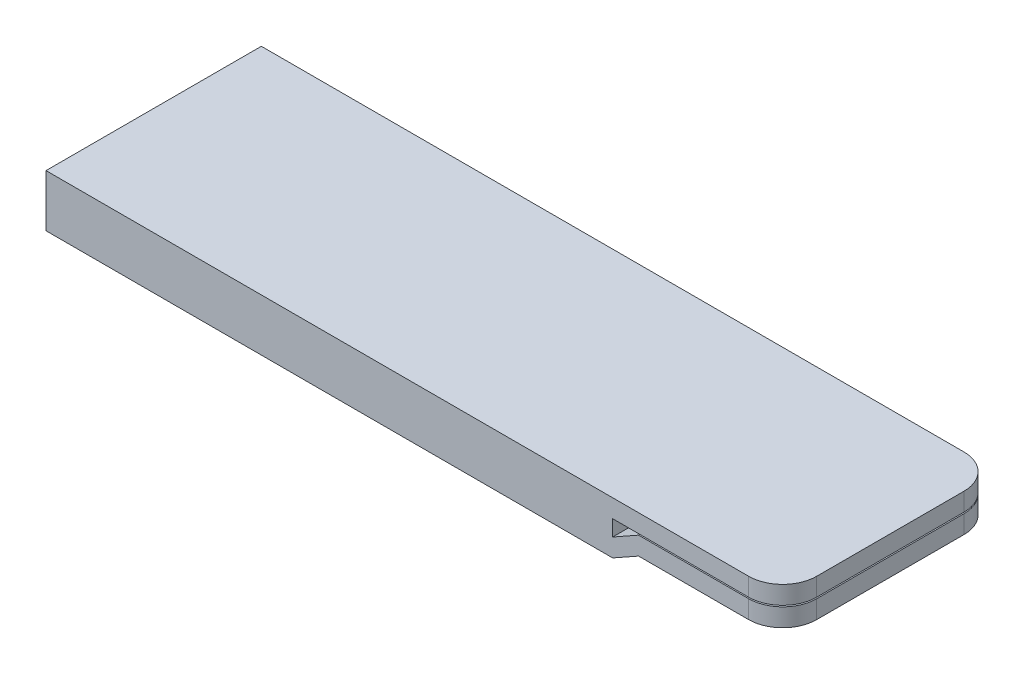
ISO-10303-21;
HEADER;
FILE_DESCRIPTION(('STEP AP214'),'2;1');
FILE_NAME('part.step','',(''),(''),'','','');
FILE_SCHEMA(('AUTOMOTIVE_DESIGN { 1 0 10303 214 1 1 1 1 }'));
ENDSEC;
DATA;
#1=APPLICATION_CONTEXT('core data for automotive mechanical design processes');
#2=APPLICATION_PROTOCOL_DEFINITION('international standard','automotive_design',2000,#1);
#3=PRODUCT_CONTEXT('',#1,'mechanical');
#4=PRODUCT('Part','Part','',(#3));
#5=PRODUCT_RELATED_PRODUCT_CATEGORY('part','',(#4));
#6=PRODUCT_DEFINITION_FORMATION('','',#4);
#7=PRODUCT_DEFINITION_CONTEXT('part definition',#1,'design');
#8=PRODUCT_DEFINITION('design','',#6,#7);
#9=PRODUCT_DEFINITION_SHAPE('','',#8);
#10=(LENGTH_UNIT() NAMED_UNIT(*) SI_UNIT(.MILLI.,.METRE.));
#11=(NAMED_UNIT(*) PLANE_ANGLE_UNIT() SI_UNIT($,.RADIAN.));
#12=(NAMED_UNIT(*) SI_UNIT($,.STERADIAN.) SOLID_ANGLE_UNIT());
#13=UNCERTAINTY_MEASURE_WITH_UNIT(LENGTH_MEASURE(1.E-05),#10,'distance_accuracy_value','');
#14=(GEOMETRIC_REPRESENTATION_CONTEXT(3) GLOBAL_UNCERTAINTY_ASSIGNED_CONTEXT((#13)) GLOBAL_UNIT_ASSIGNED_CONTEXT((#10,
#11,#12)) REPRESENTATION_CONTEXT('',''));
#15=CARTESIAN_POINT('',(0.,0.,0.));
#16=DIRECTION('',(0.,0.,1.));
#17=DIRECTION('',(1.,0.,0.));
#18=AXIS2_PLACEMENT_3D('',#15,#16,#17);
#19=CARTESIAN_POINT('',(19.7844786449521,-1.0153631434935,9.5));
#20=DIRECTION('',(0.,1.,0.));
#21=DIRECTION('',(-1.,0.,0.));
#22=AXIS2_PLACEMENT_3D('',#19,#20,#21);
#23=PLANE('',#22);
#24=DIRECTION('',(1.,0.,0.));
#25=VECTOR('',#24,1.);
#26=CARTESIAN_POINT('',(19.7844786449521,-1.0153631434935,-9.5));
#27=LINE('',#26,#25);
#28=CARTESIAN_POINT('',(19.7844786449521,-1.0153631434935,-9.5));
#29=VERTEX_POINT('',#28);
#30=CARTESIAN_POINT('',(29.5,-1.01536314349353,-9.5));
#31=VERTEX_POINT('',#30);
#32=EDGE_CURVE('E189',#29,#31,#27,.T.);
#33=ORIENTED_EDGE('',*,*,#32,.T.);
#34=CARTESIAN_POINT('',(29.5,-1.01536314349353,-6.5));
#35=DIRECTION('',(0.,1.,0.));
#36=DIRECTION('',(-1.,0.,0.));
#37=AXIS2_PLACEMENT_3D('',#34,#35,#36);
#38=CIRCLE('',#37,3.);
#39=CARTESIAN_POINT('',(32.5,-1.01536314349354,-6.5));
#40=VERTEX_POINT('',#39);
#41=EDGE_CURVE('E11',#31,#40,#38,.F.);
#42=ORIENTED_EDGE('',*,*,#41,.T.);
#43=DIRECTION('',(0.,0.,-1.));
#44=VECTOR('',#43,1.);
#45=CARTESIAN_POINT('',(32.5,-1.01536314349354,9.5));
#46=LINE('',#45,#44);
#47=CARTESIAN_POINT('',(32.5,-1.01536314349354,6.5));
#48=VERTEX_POINT('',#47);
#49=EDGE_CURVE('E229',#48,#40,#46,.T.);
#50=ORIENTED_EDGE('',*,*,#49,.F.);
#51=CARTESIAN_POINT('',(29.5,-1.01536314349353,6.5));
#52=DIRECTION('',(0.,1.,0.));
#53=DIRECTION('',(-1.,0.,0.));
#54=AXIS2_PLACEMENT_3D('',#51,#52,#53);
#55=CIRCLE('',#54,3.);
#56=CARTESIAN_POINT('',(29.5,-1.01536314349353,9.5));
#57=VERTEX_POINT('',#56);
#58=EDGE_CURVE('E45',#48,#57,#55,.F.);
#59=ORIENTED_EDGE('',*,*,#58,.T.);
#60=DIRECTION('',(1.,0.,0.));
#61=VECTOR('',#60,1.);
#62=CARTESIAN_POINT('',(19.7844786449521,-1.0153631434935,9.5));
#63=LINE('',#62,#61);
#64=CARTESIAN_POINT('',(19.7844786449521,-1.0153631434935,9.5));
#65=VERTEX_POINT('',#64);
#66=EDGE_CURVE('E156',#65,#57,#63,.T.);
#67=ORIENTED_EDGE('',*,*,#66,.F.);
#68=DIRECTION('',(0.,0.,-1.));
#69=VECTOR('',#68,1.);
#70=CARTESIAN_POINT('',(19.7844786449521,-1.0153631434935,9.5));
#71=LINE('',#70,#69);
#72=EDGE_CURVE('E188',#65,#29,#71,.T.);
#73=ORIENTED_EDGE('',*,*,#72,.T.);
#74=EDGE_LOOP('',(#33,#42,#50,#59,#67,#73));
#75=FACE_BOUND('',#74,.T.);
#76=ADVANCED_FACE('F37',(#75),#23,.F.);
#77=CARTESIAN_POINT('',(32.5,-1.01536314349354,9.5));
#78=DIRECTION('',(-1.,0.,0.));
#79=DIRECTION('',(0.,0.,1.));
#80=AXIS2_PLACEMENT_3D('',#77,#78,#79);
#81=PLANE('',#80);
#82=ORIENTED_EDGE('',*,*,#49,.T.);
#83=DIRECTION('',(0.,1.,0.));
#84=VECTOR('',#83,1.);
#85=CARTESIAN_POINT('',(32.5,-1.01536314349354,-6.5));
#86=LINE('',#85,#84);
#87=CARTESIAN_POINT('',(32.5,0.584636856506462,-6.5));
#88=VERTEX_POINT('',#87);
#89=EDGE_CURVE('E253',#40,#88,#86,.T.);
#90=ORIENTED_EDGE('',*,*,#89,.T.);
#91=DIRECTION('',(0.,0.,-1.));
#92=VECTOR('',#91,1.);
#93=CARTESIAN_POINT('',(32.5,0.584636856506462,9.5));
#94=LINE('',#93,#92);
#95=CARTESIAN_POINT('',(32.5,0.584636856506462,6.5));
#96=VERTEX_POINT('',#95);
#97=EDGE_CURVE('E167',#96,#88,#94,.T.);
#98=ORIENTED_EDGE('',*,*,#97,.F.);
#99=DIRECTION('',(0.,1.,0.));
#100=VECTOR('',#99,1.);
#101=CARTESIAN_POINT('',(32.5,-1.01536314349354,6.5));
#102=LINE('',#101,#100);
#103=EDGE_CURVE('E57',#96,#48,#102,.F.);
#104=ORIENTED_EDGE('',*,*,#103,.T.);
#105=EDGE_LOOP('',(#82,#90,#98,#104));
#106=FACE_BOUND('',#105,.T.);
#107=ADVANCED_FACE('F264',(#106),#81,.F.);
#108=CARTESIAN_POINT('',(32.5,0.584636856506462,9.5));
#109=DIRECTION('',(0.,-1.,0.));
#110=DIRECTION('',(1.,0.,0.));
#111=AXIS2_PLACEMENT_3D('',#108,#109,#110);
#112=PLANE('',#111);
#113=ORIENTED_EDGE('',*,*,#97,.T.);
#114=CARTESIAN_POINT('',(29.5,0.58463685650647,-6.5));
#115=DIRECTION('',(0.,-1.,0.));
#116=DIRECTION('',(1.,0.,0.));
#117=AXIS2_PLACEMENT_3D('',#114,#115,#116);
#118=CIRCLE('',#117,3.);
#119=CARTESIAN_POINT('',(29.5,0.58463685650647,-9.5));
#120=VERTEX_POINT('',#119);
#121=EDGE_CURVE('E258',#88,#120,#118,.F.);
#122=ORIENTED_EDGE('',*,*,#121,.T.);
#123=DIRECTION('',(-1.,0.,0.));
#124=VECTOR('',#123,1.);
#125=CARTESIAN_POINT('',(32.5,0.584636856506462,-9.5));
#126=LINE('',#125,#124);
#127=CARTESIAN_POINT('',(19.7844786449521,0.584636856506497,-9.5));
#128=VERTEX_POINT('',#127);
#129=EDGE_CURVE('E163',#120,#128,#126,.T.);
#130=ORIENTED_EDGE('',*,*,#129,.T.);
#131=DIRECTION('',(0.,0.,-1.));
#132=VECTOR('',#131,1.);
#133=CARTESIAN_POINT('',(19.7844786449521,0.584636856506497,9.5));
#134=LINE('',#133,#132);
#135=CARTESIAN_POINT('',(19.7844786449521,0.584636856506497,9.5));
#136=VERTEX_POINT('',#135);
#137=EDGE_CURVE('E159',#136,#128,#134,.T.);
#138=ORIENTED_EDGE('',*,*,#137,.F.);
#139=DIRECTION('',(-1.,0.,0.));
#140=VECTOR('',#139,1.);
#141=CARTESIAN_POINT('',(32.5,0.584636856506462,9.5));
#142=LINE('',#141,#140);
#143=CARTESIAN_POINT('',(29.5,0.58463685650647,9.5));
#144=VERTEX_POINT('',#143);
#145=EDGE_CURVE('E144',#144,#136,#142,.T.);
#146=ORIENTED_EDGE('',*,*,#145,.F.);
#147=CARTESIAN_POINT('',(29.5,0.58463685650647,6.5));
#148=DIRECTION('',(0.,-1.,0.));
#149=DIRECTION('',(1.,0.,0.));
#150=AXIS2_PLACEMENT_3D('',#147,#148,#149);
#151=CIRCLE('',#150,3.);
#152=EDGE_CURVE('E256',#144,#96,#151,.F.);
#153=ORIENTED_EDGE('',*,*,#152,.T.);
#154=EDGE_LOOP('',(#113,#122,#130,#138,#146,#153));
#155=FACE_BOUND('',#154,.T.);
#156=ADVANCED_FACE('F161',(#155),#112,.F.);
#157=CARTESIAN_POINT('',(19.7844786449521,0.584636856506497,9.5));
#158=DIRECTION('',(0.49015040609207,-0.871637871714957,0.));
#159=DIRECTION('',(0.871637871714956,0.49015040609207,0.));
#160=AXIS2_PLACEMENT_3D('',#157,#158,#159);
#161=PLANE('',#160);
#162=DIRECTION('',(-0.871637871714956,-0.49015040609207,0.));
#163=VECTOR('',#162,1.);
#164=CARTESIAN_POINT('',(19.7844786449521,0.584636856506497,-9.5));
#165=LINE('',#164,#163);
#166=CARTESIAN_POINT('',(17.5,-0.700000000000002,-9.5));
#167=VERTEX_POINT('',#166);
#168=EDGE_CURVE('E192',#128,#167,#165,.T.);
#169=ORIENTED_EDGE('',*,*,#168,.T.);
#170=DIRECTION('',(0.,0.,-1.));
#171=VECTOR('',#170,1.);
#172=CARTESIAN_POINT('',(17.5,-0.700000000000002,9.5));
#173=LINE('',#172,#171);
#174=CARTESIAN_POINT('',(17.5,-0.700000000000002,9.5));
#175=VERTEX_POINT('',#174);
#176=EDGE_CURVE('E168',#175,#167,#173,.T.);
#177=ORIENTED_EDGE('',*,*,#176,.F.);
#178=DIRECTION('',(-0.871637871714956,-0.49015040609207,0.));
#179=VECTOR('',#178,1.);
#180=CARTESIAN_POINT('',(19.7844786449521,0.584636856506497,9.5));
#181=LINE('',#180,#179);
#182=EDGE_CURVE('E150',#136,#175,#181,.T.);
#183=ORIENTED_EDGE('',*,*,#182,.F.);
#184=ORIENTED_EDGE('',*,*,#137,.T.);
#185=EDGE_LOOP('',(#169,#177,#183,#184));
#186=FACE_BOUND('',#185,.T.);
#187=ADVANCED_FACE('F170',(#186),#161,.F.);
#188=CARTESIAN_POINT('',(17.5,0.700000000000002,9.5));
#189=DIRECTION('',(1.,0.,0.));
#190=DIRECTION('',(0.,0.,-1.));
#191=AXIS2_PLACEMENT_3D('',#188,#189,#190);
#192=PLANE('',#191);
#193=DIRECTION('',(0.,-1.,0.));
#194=VECTOR('',#193,1.);
#195=CARTESIAN_POINT('',(17.5,0.700000000000002,-9.5));
#196=LINE('',#195,#194);
#197=CARTESIAN_POINT('',(17.5,0.700000000000002,-9.5));
#198=VERTEX_POINT('',#197);
#199=EDGE_CURVE('E194',#198,#167,#196,.T.);
#200=ORIENTED_EDGE('',*,*,#199,.F.);
#201=DIRECTION('',(0.,0.,-1.));
#202=VECTOR('',#201,1.);
#203=CARTESIAN_POINT('',(17.5,0.700000000000002,9.5));
#204=LINE('',#203,#202);
#205=CARTESIAN_POINT('',(17.5,0.700000000000002,9.5));
#206=VERTEX_POINT('',#205);
#207=EDGE_CURVE('E224',#206,#198,#204,.T.);
#208=ORIENTED_EDGE('',*,*,#207,.F.);
#209=DIRECTION('',(0.,-1.,0.));
#210=VECTOR('',#209,1.);
#211=CARTESIAN_POINT('',(17.5,0.700000000000002,9.5));
#212=LINE('',#211,#210);
#213=EDGE_CURVE('E172',#206,#175,#212,.T.);
#214=ORIENTED_EDGE('',*,*,#213,.T.);
#215=ORIENTED_EDGE('',*,*,#176,.T.);
#216=EDGE_LOOP('',(#200,#208,#214,#215));
#217=FACE_BOUND('',#216,.T.);
#218=ADVANCED_FACE('F276',(#217),#192,.T.);
#219=CARTESIAN_POINT('',(32.5,0.7,9.5));
#220=DIRECTION('',(0.,-1.,0.));
#221=DIRECTION('',(1.,0.,0.));
#222=AXIS2_PLACEMENT_3D('',#219,#220,#221);
#223=PLANE('',#222);
#224=DIRECTION('',(-1.,0.,0.));
#225=VECTOR('',#224,1.);
#226=CARTESIAN_POINT('',(32.5,0.7,-9.5));
#227=LINE('',#226,#225);
#228=CARTESIAN_POINT('',(29.5,0.7,-9.5));
#229=VERTEX_POINT('',#228);
#230=EDGE_CURVE('E197',#229,#198,#227,.T.);
#231=ORIENTED_EDGE('',*,*,#230,.F.);
#232=CARTESIAN_POINT('',(29.5,0.7,-6.5));
#233=DIRECTION('',(0.,-1.,0.));
#234=DIRECTION('',(1.,0.,0.));
#235=AXIS2_PLACEMENT_3D('',#232,#233,#234);
#236=CIRCLE('',#235,3.);
#237=CARTESIAN_POINT('',(32.5,0.7,-6.5));
#238=VERTEX_POINT('',#237);
#239=EDGE_CURVE('E238',#229,#238,#236,.T.);
#240=ORIENTED_EDGE('',*,*,#239,.T.);
#241=DIRECTION('',(0.,0.,-1.));
#242=VECTOR('',#241,1.);
#243=CARTESIAN_POINT('',(32.5,0.7,9.5));
#244=LINE('',#243,#242);
#245=CARTESIAN_POINT('',(32.5,0.7,6.5));
#246=VERTEX_POINT('',#245);
#247=EDGE_CURVE('E221',#246,#238,#244,.T.);
#248=ORIENTED_EDGE('',*,*,#247,.F.);
#249=CARTESIAN_POINT('',(29.5,0.7,6.5));
#250=DIRECTION('',(0.,-1.,0.));
#251=DIRECTION('',(1.,0.,0.));
#252=AXIS2_PLACEMENT_3D('',#249,#250,#251);
#253=CIRCLE('',#252,3.);
#254=CARTESIAN_POINT('',(29.5,0.7,9.5));
#255=VERTEX_POINT('',#254);
#256=EDGE_CURVE('E236',#246,#255,#253,.T.);
#257=ORIENTED_EDGE('',*,*,#256,.T.);
#258=DIRECTION('',(-1.,0.,0.));
#259=VECTOR('',#258,1.);
#260=CARTESIAN_POINT('',(32.5,0.7,9.5));
#261=LINE('',#260,#259);
#262=EDGE_CURVE('E174',#255,#206,#261,.T.);
#263=ORIENTED_EDGE('',*,*,#262,.T.);
#264=ORIENTED_EDGE('',*,*,#207,.T.);
#265=EDGE_LOOP('',(#231,#240,#248,#257,#263,#264));
#266=FACE_BOUND('',#265,.T.);
#267=ADVANCED_FACE('F380',(#266),#223,.T.);
#268=CARTESIAN_POINT('',(32.5,2.3,9.5));
#269=DIRECTION('',(1.,0.,0.));
#270=DIRECTION('',(0.,0.,-1.));
#271=AXIS2_PLACEMENT_3D('',#268,#269,#270);
#272=PLANE('',#271);
#273=ORIENTED_EDGE('',*,*,#247,.T.);
#274=DIRECTION('',(0.,-1.,0.));
#275=VECTOR('',#274,1.);
#276=CARTESIAN_POINT('',(32.5,2.3,-6.5));
#277=LINE('',#276,#275);
#278=CARTESIAN_POINT('',(32.5,2.3,-6.5));
#279=VERTEX_POINT('',#278);
#280=EDGE_CURVE('E243',#238,#279,#277,.F.);
#281=ORIENTED_EDGE('',*,*,#280,.T.);
#282=DIRECTION('',(0.,0.,-1.));
#283=VECTOR('',#282,1.);
#284=CARTESIAN_POINT('',(32.5,2.3,9.5));
#285=LINE('',#284,#283);
#286=CARTESIAN_POINT('',(32.5,2.3,6.5));
#287=VERTEX_POINT('',#286);
#288=EDGE_CURVE('E218',#287,#279,#285,.T.);
#289=ORIENTED_EDGE('',*,*,#288,.F.);
#290=DIRECTION('',(0.,-1.,0.));
#291=VECTOR('',#290,1.);
#292=CARTESIAN_POINT('',(32.5,2.3,6.5));
#293=LINE('',#292,#291);
#294=EDGE_CURVE('E240',#287,#246,#293,.T.);
#295=ORIENTED_EDGE('',*,*,#294,.T.);
#296=EDGE_LOOP('',(#273,#281,#289,#295));
#297=FACE_BOUND('',#296,.T.);
#298=ADVANCED_FACE('F289',(#297),#272,.T.);
#299=CARTESIAN_POINT('',(-32.5,2.3,9.5));
#300=DIRECTION('',(0.,1.,0.));
#301=DIRECTION('',(0.,0.,1.));
#302=AXIS2_PLACEMENT_3D('',#299,#300,#301);
#303=PLANE('',#302);
#304=ORIENTED_EDGE('',*,*,#288,.T.);
#305=CARTESIAN_POINT('',(29.5,2.3,-6.5));
#306=DIRECTION('',(0.,1.,0.));
#307=DIRECTION('',(0.,0.,1.));
#308=AXIS2_PLACEMENT_3D('',#305,#306,#307);
#309=CIRCLE('',#308,3.);
#310=CARTESIAN_POINT('',(29.5,2.3,-9.5));
#311=VERTEX_POINT('',#310);
#312=EDGE_CURVE('E247',#279,#311,#309,.T.);
#313=ORIENTED_EDGE('',*,*,#312,.T.);
#314=DIRECTION('',(1.,0.,0.));
#315=VECTOR('',#314,1.);
#316=CARTESIAN_POINT('',(-32.5,2.3,-9.5));
#317=LINE('',#316,#315);
#318=CARTESIAN_POINT('',(-32.5,2.3,-9.5));
#319=VERTEX_POINT('',#318);
#320=EDGE_CURVE('E199',#319,#311,#317,.T.);
#321=ORIENTED_EDGE('',*,*,#320,.F.);
#322=DIRECTION('',(0.,0.,-1.));
#323=VECTOR('',#322,1.);
#324=CARTESIAN_POINT('',(-32.5,2.3,9.5));
#325=LINE('',#324,#323);
#326=CARTESIAN_POINT('',(-32.5,2.3,9.5));
#327=VERTEX_POINT('',#326);
#328=EDGE_CURVE('E216',#327,#319,#325,.T.);
#329=ORIENTED_EDGE('',*,*,#328,.F.);
#330=DIRECTION('',(1.,0.,0.));
#331=VECTOR('',#330,1.);
#332=CARTESIAN_POINT('',(-32.5,2.3,9.5));
#333=LINE('',#332,#331);
#334=CARTESIAN_POINT('',(29.5,2.3,9.5));
#335=VERTEX_POINT('',#334);
#336=EDGE_CURVE('E179',#327,#335,#333,.T.);
#337=ORIENTED_EDGE('',*,*,#336,.T.);
#338=CARTESIAN_POINT('',(29.5,2.3,6.5));
#339=DIRECTION('',(0.,1.,0.));
#340=DIRECTION('',(0.,0.,1.));
#341=AXIS2_PLACEMENT_3D('',#338,#339,#340);
#342=CIRCLE('',#341,3.);
#343=EDGE_CURVE('E245',#335,#287,#342,.T.);
#344=ORIENTED_EDGE('',*,*,#343,.T.);
#345=EDGE_LOOP('',(#304,#313,#321,#329,#337,#344));
#346=FACE_BOUND('',#345,.T.);
#347=ADVANCED_FACE('F286',(#346),#303,.T.);
#348=CARTESIAN_POINT('',(-32.5,2.3,9.5));
#349=DIRECTION('',(1.,0.,0.));
#350=DIRECTION('',(0.,0.,-1.));
#351=AXIS2_PLACEMENT_3D('',#348,#349,#350);
#352=PLANE('',#351);
#353=DIRECTION('',(0.,-1.,0.));
#354=VECTOR('',#353,1.);
#355=CARTESIAN_POINT('',(-32.5,2.3,-9.5));
#356=LINE('',#355,#354);
#357=CARTESIAN_POINT('',(-32.5,-2.3,-9.5));
#358=VERTEX_POINT('',#357);
#359=EDGE_CURVE('E202',#319,#358,#356,.T.);
#360=ORIENTED_EDGE('',*,*,#359,.T.);
#361=DIRECTION('',(0.,0.,-1.));
#362=VECTOR('',#361,1.);
#363=CARTESIAN_POINT('',(-32.5,-2.3,9.5));
#364=LINE('',#363,#362);
#365=CARTESIAN_POINT('',(-32.5,-2.3,9.5));
#366=VERTEX_POINT('',#365);
#367=EDGE_CURVE('E213',#366,#358,#364,.T.);
#368=ORIENTED_EDGE('',*,*,#367,.F.);
#369=DIRECTION('',(0.,-1.,0.));
#370=VECTOR('',#369,1.);
#371=CARTESIAN_POINT('',(-32.5,2.3,9.5));
#372=LINE('',#371,#370);
#373=EDGE_CURVE('E182',#327,#366,#372,.T.);
#374=ORIENTED_EDGE('',*,*,#373,.F.);
#375=ORIENTED_EDGE('',*,*,#328,.T.);
#376=EDGE_LOOP('',(#360,#368,#374,#375));
#377=FACE_BOUND('',#376,.T.);
#378=ADVANCED_FACE('F301',(#377),#352,.F.);
#379=CARTESIAN_POINT('',(-32.5,-2.3,9.5));
#380=DIRECTION('',(0.,1.,0.));
#381=DIRECTION('',(0.,0.,1.));
#382=AXIS2_PLACEMENT_3D('',#379,#380,#381);
#383=PLANE('',#382);
#384=DIRECTION('',(1.,0.,0.));
#385=VECTOR('',#384,1.);
#386=CARTESIAN_POINT('',(-32.5,-2.3,-9.5));
#387=LINE('',#386,#385);
#388=CARTESIAN_POINT('',(17.5,-2.3,-9.5));
#389=VERTEX_POINT('',#388);
#390=EDGE_CURVE('E204',#358,#389,#387,.T.);
#391=ORIENTED_EDGE('',*,*,#390,.T.);
#392=DIRECTION('',(0.,0.,-1.));
#393=VECTOR('',#392,1.);
#394=CARTESIAN_POINT('',(17.5,-2.3,9.5));
#395=LINE('',#394,#393);
#396=CARTESIAN_POINT('',(17.5,-2.3,9.5));
#397=VERTEX_POINT('',#396);
#398=EDGE_CURVE('E210',#397,#389,#395,.T.);
#399=ORIENTED_EDGE('',*,*,#398,.F.);
#400=DIRECTION('',(1.,0.,0.));
#401=VECTOR('',#400,1.);
#402=CARTESIAN_POINT('',(-32.5,-2.3,9.5));
#403=LINE('',#402,#401);
#404=EDGE_CURVE('E184',#366,#397,#403,.T.);
#405=ORIENTED_EDGE('',*,*,#404,.F.);
#406=ORIENTED_EDGE('',*,*,#367,.T.);
#407=EDGE_LOOP('',(#391,#399,#405,#406));
#408=FACE_BOUND('',#407,.T.);
#409=ADVANCED_FACE('F305',(#408),#383,.F.);
#410=CARTESIAN_POINT('',(17.5,-2.3,9.5));
#411=DIRECTION('',(-0.49015040609207,0.871637871714957,0.));
#412=DIRECTION('',(-0.871637871714957,-0.49015040609207,0.));
#413=AXIS2_PLACEMENT_3D('',#410,#411,#412);
#414=PLANE('',#413);
#415=DIRECTION('',(0.871637871714956,0.49015040609207,0.));
#416=VECTOR('',#415,1.);
#417=CARTESIAN_POINT('',(17.5,-2.3,-9.5));
#418=LINE('',#417,#416);
#419=EDGE_CURVE('E206',#389,#29,#418,.T.);
#420=ORIENTED_EDGE('',*,*,#419,.T.);
#421=ORIENTED_EDGE('',*,*,#72,.F.);
#422=DIRECTION('',(0.871637871714956,0.49015040609207,0.));
#423=VECTOR('',#422,1.);
#424=CARTESIAN_POINT('',(17.5,-2.3,9.5));
#425=LINE('',#424,#423);
#426=EDGE_CURVE('E186',#397,#65,#425,.T.);
#427=ORIENTED_EDGE('',*,*,#426,.F.);
#428=ORIENTED_EDGE('',*,*,#398,.T.);
#429=EDGE_LOOP('',(#420,#421,#427,#428));
#430=FACE_BOUND('',#429,.T.);
#431=ADVANCED_FACE('F308',(#430),#414,.F.);
#432=CARTESIAN_POINT('',(0.,0.,9.5));
#433=DIRECTION('',(0.,0.,1.));
#434=DIRECTION('',(1.,0.,0.));
#435=AXIS2_PLACEMENT_3D('',#432,#433,#434);
#436=PLANE('',#435);
#437=ORIENTED_EDGE('',*,*,#262,.F.);
#438=DIRECTION('',(0.,-1.,0.));
#439=VECTOR('',#438,1.);
#440=CARTESIAN_POINT('',(29.5,0.,9.5));
#441=LINE('',#440,#439);
#442=EDGE_CURVE('E250',#255,#335,#441,.F.);
#443=ORIENTED_EDGE('',*,*,#442,.T.);
#444=ORIENTED_EDGE('',*,*,#336,.F.);
#445=ORIENTED_EDGE('',*,*,#373,.T.);
#446=ORIENTED_EDGE('',*,*,#404,.T.);
#447=ORIENTED_EDGE('',*,*,#426,.T.);
#448=ORIENTED_EDGE('',*,*,#66,.T.);
#449=DIRECTION('',(0.,1.,0.));
#450=VECTOR('',#449,1.);
#451=CARTESIAN_POINT('',(29.5,0.584636856506462,9.5));
#452=LINE('',#451,#450);
#453=EDGE_CURVE('E154',#57,#144,#452,.T.);
#454=ORIENTED_EDGE('',*,*,#453,.T.);
#455=ORIENTED_EDGE('',*,*,#145,.T.);
#456=ORIENTED_EDGE('',*,*,#182,.T.);
#457=ORIENTED_EDGE('',*,*,#213,.F.);
#458=EDGE_LOOP('',(#437,#443,#444,#445,#446,#447,#448,#454,#455,#456,#457));
#459=FACE_BOUND('',#458,.T.);
#460=ADVANCED_FACE('F147',(#459),#436,.T.);
#461=CARTESIAN_POINT('',(0.,0.,-9.5));
#462=DIRECTION('',(0.,0.,1.));
#463=DIRECTION('',(1.,0.,0.));
#464=AXIS2_PLACEMENT_3D('',#461,#462,#463);
#465=PLANE('',#464);
#466=ORIENTED_EDGE('',*,*,#320,.T.);
#467=DIRECTION('',(0.,-1.,0.));
#468=VECTOR('',#467,1.);
#469=CARTESIAN_POINT('',(29.5,0.7,-9.5));
#470=LINE('',#469,#468);
#471=EDGE_CURVE('E233',#311,#229,#470,.T.);
#472=ORIENTED_EDGE('',*,*,#471,.T.);
#473=ORIENTED_EDGE('',*,*,#230,.T.);
#474=ORIENTED_EDGE('',*,*,#199,.T.);
#475=ORIENTED_EDGE('',*,*,#168,.F.);
#476=ORIENTED_EDGE('',*,*,#129,.F.);
#477=DIRECTION('',(0.,1.,0.));
#478=VECTOR('',#477,1.);
#479=CARTESIAN_POINT('',(29.5,0.,-9.5));
#480=LINE('',#479,#478);
#481=EDGE_CURVE('E231',#120,#31,#480,.F.);
#482=ORIENTED_EDGE('',*,*,#481,.T.);
#483=ORIENTED_EDGE('',*,*,#32,.F.);
#484=ORIENTED_EDGE('',*,*,#419,.F.);
#485=ORIENTED_EDGE('',*,*,#390,.F.);
#486=ORIENTED_EDGE('',*,*,#359,.F.);
#487=EDGE_LOOP('',(#466,#472,#473,#474,#475,#476,#482,#483,#484,#485,#486));
#488=FACE_BOUND('',#487,.T.);
#489=ADVANCED_FACE('F270',(#488),#465,.F.);
#490=CARTESIAN_POINT('',(29.5,0.,-6.5));
#491=DIRECTION('',(0.,1.,0.));
#492=DIRECTION('',(0.,0.,1.));
#493=AXIS2_PLACEMENT_3D('',#490,#491,#492);
#494=CYLINDRICAL_SURFACE('',#493,3.);
#495=ORIENTED_EDGE('',*,*,#312,.F.);
#496=ORIENTED_EDGE('',*,*,#280,.F.);
#497=ORIENTED_EDGE('',*,*,#239,.F.);
#498=ORIENTED_EDGE('',*,*,#471,.F.);
#499=EDGE_LOOP('',(#495,#496,#497,#498));
#500=FACE_BOUND('',#499,.T.);
#501=ADVANCED_FACE('F293',(#500),#494,.T.);
#502=CARTESIAN_POINT('',(29.5,2.3,6.5));
#503=DIRECTION('',(0.,-1.,0.));
#504=DIRECTION('',(0.,0.,-1.));
#505=AXIS2_PLACEMENT_3D('',#502,#503,#504);
#506=CYLINDRICAL_SURFACE('',#505,3.);
#507=ORIENTED_EDGE('',*,*,#343,.F.);
#508=ORIENTED_EDGE('',*,*,#442,.F.);
#509=ORIENTED_EDGE('',*,*,#256,.F.);
#510=ORIENTED_EDGE('',*,*,#294,.F.);
#511=EDGE_LOOP('',(#507,#508,#509,#510));
#512=FACE_BOUND('',#511,.T.);
#513=ADVANCED_FACE('F282',(#512),#506,.T.);
#514=CARTESIAN_POINT('',(29.5,-1.01536314349354,-6.5));
#515=DIRECTION('',(0.,1.,0.));
#516=DIRECTION('',(0.,0.,1.));
#517=AXIS2_PLACEMENT_3D('',#514,#515,#516);
#518=CYLINDRICAL_SURFACE('',#517,3.);
#519=ORIENTED_EDGE('',*,*,#41,.F.);
#520=ORIENTED_EDGE('',*,*,#481,.F.);
#521=ORIENTED_EDGE('',*,*,#121,.F.);
#522=ORIENTED_EDGE('',*,*,#89,.F.);
#523=EDGE_LOOP('',(#519,#520,#521,#522));
#524=FACE_BOUND('',#523,.T.);
#525=ADVANCED_FACE('F267',(#524),#518,.T.);
#526=CARTESIAN_POINT('',(29.5,0.,6.5));
#527=DIRECTION('',(0.,-1.,0.));
#528=DIRECTION('',(0.,0.,-1.));
#529=AXIS2_PLACEMENT_3D('',#526,#527,#528);
#530=CYLINDRICAL_SURFACE('',#529,3.);
#531=ORIENTED_EDGE('',*,*,#58,.F.);
#532=ORIENTED_EDGE('',*,*,#103,.F.);
#533=ORIENTED_EDGE('',*,*,#152,.F.);
#534=ORIENTED_EDGE('',*,*,#453,.F.);
#535=EDGE_LOOP('',(#531,#532,#533,#534));
#536=FACE_BOUND('',#535,.T.);
#537=ADVANCED_FACE('F39',(#536),#530,.T.);
#538=CLOSED_SHELL('',(#76,#107,#156,#187,#218,#267,#298,#347,#378,#409,#431,#460,#489,#501,#513,
#525,#537));
#539=MANIFOLD_SOLID_BREP('B2',#538);
#540=ADVANCED_BREP_SHAPE_REPRESENTATION('',(#18,#539),#14);
#541=SHAPE_DEFINITION_REPRESENTATION(#9,#540);
ENDSEC;
END-ISO-10303-21;
